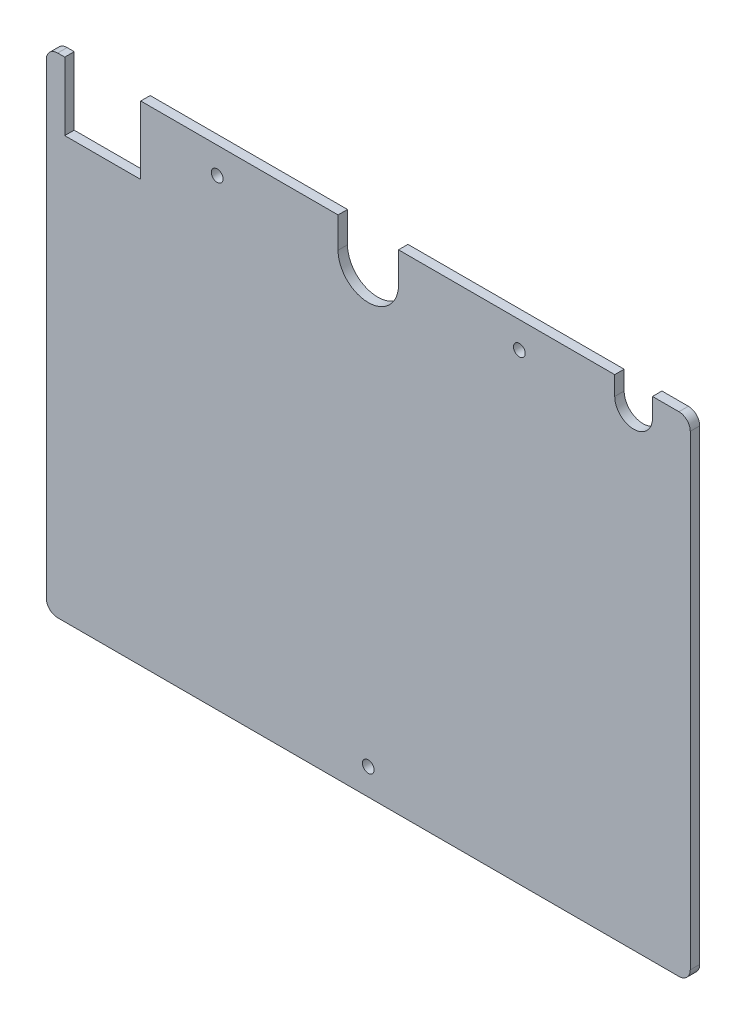
ISO-10303-21;
HEADER;
FILE_DESCRIPTION(('STEP AP214'),'2;1');
FILE_NAME('part.step','',(''),(''),'','','');
FILE_SCHEMA(('AUTOMOTIVE_DESIGN { 1 0 10303 214 1 1 1 1 }'));
ENDSEC;
DATA;
#1=APPLICATION_CONTEXT('core data for automotive mechanical design processes');
#2=APPLICATION_PROTOCOL_DEFINITION('international standard','automotive_design',2000,#1);
#3=PRODUCT_CONTEXT('',#1,'mechanical');
#4=PRODUCT('Part','Part','',(#3));
#5=PRODUCT_RELATED_PRODUCT_CATEGORY('part','',(#4));
#6=PRODUCT_DEFINITION_FORMATION('','',#4);
#7=PRODUCT_DEFINITION_CONTEXT('part definition',#1,'design');
#8=PRODUCT_DEFINITION('design','',#6,#7);
#9=PRODUCT_DEFINITION_SHAPE('','',#8);
#10=(LENGTH_UNIT() NAMED_UNIT(*) SI_UNIT(.MILLI.,.METRE.));
#11=(NAMED_UNIT(*) PLANE_ANGLE_UNIT() SI_UNIT($,.RADIAN.));
#12=(NAMED_UNIT(*) SI_UNIT($,.STERADIAN.) SOLID_ANGLE_UNIT());
#13=UNCERTAINTY_MEASURE_WITH_UNIT(LENGTH_MEASURE(1.E-05),#10,'distance_accuracy_value','');
#14=(GEOMETRIC_REPRESENTATION_CONTEXT(3) GLOBAL_UNCERTAINTY_ASSIGNED_CONTEXT((#13)) GLOBAL_UNIT_ASSIGNED_CONTEXT((#10,
#11,#12)) REPRESENTATION_CONTEXT('',''));
#15=CARTESIAN_POINT('',(0.,0.,0.));
#16=DIRECTION('',(0.,0.,1.));
#17=DIRECTION('',(1.,0.,0.));
#18=AXIS2_PLACEMENT_3D('',#15,#16,#17);
#19=CARTESIAN_POINT('',(-82.25,64.75,2.5));
#20=DIRECTION('',(0.,-1.,0.));
#21=DIRECTION('',(0.,0.,-1.));
#22=AXIS2_PLACEMENT_3D('',#19,#20,#21);
#23=PLANE('',#22);
#24=DIRECTION('',(-1.,0.,0.));
#25=VECTOR('',#24,1.);
#26=CARTESIAN_POINT('',(-82.25,64.75,0.));
#27=LINE('',#26,#25);
#28=CARTESIAN_POINT('',(-8.,64.75,0.));
#29=VERTEX_POINT('',#28);
#30=CARTESIAN_POINT('',(-60.25,64.75,0.));
#31=VERTEX_POINT('',#30);
#32=EDGE_CURVE('E189',#29,#31,#27,.T.);
#33=ORIENTED_EDGE('',*,*,#32,.T.);
#34=DIRECTION('',(0.,0.,1.));
#35=VECTOR('',#34,1.);
#36=CARTESIAN_POINT('',(-60.25,64.75,0.));
#37=LINE('',#36,#35);
#38=CARTESIAN_POINT('',(-60.25,64.75,2.5));
#39=VERTEX_POINT('',#38);
#40=EDGE_CURVE('E172',#31,#39,#37,.T.);
#41=ORIENTED_EDGE('',*,*,#40,.T.);
#42=DIRECTION('',(-1.,0.,0.));
#43=VECTOR('',#42,1.);
#44=CARTESIAN_POINT('',(-82.25,64.75,2.5));
#45=LINE('',#44,#43);
#46=CARTESIAN_POINT('',(-8.,64.75,2.5));
#47=VERTEX_POINT('',#46);
#48=EDGE_CURVE('E357',#47,#39,#45,.T.);
#49=ORIENTED_EDGE('',*,*,#48,.F.);
#50=DIRECTION('',(0.,0.,1.));
#51=VECTOR('',#50,1.);
#52=CARTESIAN_POINT('',(-8.,64.75,0.));
#53=LINE('',#52,#51);
#54=EDGE_CURVE('E195',#29,#47,#53,.T.);
#55=ORIENTED_EDGE('',*,*,#54,.F.);
#56=EDGE_LOOP('',(#33,#41,#49,#55));
#57=FACE_BOUND('',#56,.T.);
#58=ADVANCED_FACE('F35',(#57),#23,.F.);
#59=CARTESIAN_POINT('',(-80.3641675290053,64.75,2.5));
#60=VERTEX_POINT('',#59);
#61=CARTESIAN_POINT('',(-82.25,64.75,2.5));
#62=VERTEX_POINT('',#61);
#63=EDGE_CURVE('E258',#60,#62,#45,.T.);
#64=ORIENTED_EDGE('',*,*,#63,.F.);
#65=DIRECTION('',(0.,0.,1.));
#66=VECTOR('',#65,1.);
#67=CARTESIAN_POINT('',(-80.3641675290053,64.75,0.));
#68=LINE('',#67,#66);
#69=CARTESIAN_POINT('',(-80.3641675290053,64.75,0.));
#70=VERTEX_POINT('',#69);
#71=EDGE_CURVE('E182',#70,#60,#68,.T.);
#72=ORIENTED_EDGE('',*,*,#71,.F.);
#73=CARTESIAN_POINT('',(-82.25,64.75,0.));
#74=VERTEX_POINT('',#73);
#75=EDGE_CURVE('E197',#70,#74,#27,.T.);
#76=ORIENTED_EDGE('',*,*,#75,.T.);
#77=DIRECTION('',(0.,0.,-1.));
#78=VECTOR('',#77,1.);
#79=CARTESIAN_POINT('',(-82.25,64.75,2.5));
#80=LINE('',#79,#78);
#81=EDGE_CURVE('E218',#62,#74,#80,.T.);
#82=ORIENTED_EDGE('',*,*,#81,.F.);
#83=EDGE_LOOP('',(#64,#72,#76,#82));
#84=FACE_BOUND('',#83,.T.);
#85=ADVANCED_FACE('F353',(#84),#23,.F.);
#86=CARTESIAN_POINT('',(65.25,64.75,0.));
#87=VERTEX_POINT('',#86);
#88=CARTESIAN_POINT('',(7.99999999999998,64.75,0.));
#89=VERTEX_POINT('',#88);
#90=EDGE_CURVE('E196',#87,#89,#27,.T.);
#91=ORIENTED_EDGE('',*,*,#90,.T.);
#92=DIRECTION('',(0.,0.,1.));
#93=VECTOR('',#92,1.);
#94=CARTESIAN_POINT('',(8.,64.75,0.));
#95=LINE('',#94,#93);
#96=CARTESIAN_POINT('',(8.,64.75,2.5));
#97=VERTEX_POINT('',#96);
#98=EDGE_CURVE('E296',#89,#97,#95,.T.);
#99=ORIENTED_EDGE('',*,*,#98,.T.);
#100=CARTESIAN_POINT('',(65.25,64.75,2.5));
#101=VERTEX_POINT('',#100);
#102=EDGE_CURVE('E257',#101,#97,#45,.T.);
#103=ORIENTED_EDGE('',*,*,#102,.F.);
#104=DIRECTION('',(0.,0.,1.));
#105=VECTOR('',#104,1.);
#106=CARTESIAN_POINT('',(65.25,64.75,0.));
#107=LINE('',#106,#105);
#108=EDGE_CURVE('E275',#87,#101,#107,.T.);
#109=ORIENTED_EDGE('',*,*,#108,.F.);
#110=EDGE_LOOP('',(#91,#99,#103,#109));
#111=FACE_BOUND('',#110,.T.);
#112=ADVANCED_FACE('F369',(#111),#23,.F.);
#113=CARTESIAN_POINT('',(-82.25,-61.75,2.5));
#114=DIRECTION('',(0.,0.,-1.));
#115=DIRECTION('',(-1.,0.,0.));
#116=AXIS2_PLACEMENT_3D('',#113,#114,#115);
#117=CYLINDRICAL_SURFACE('',#116,3.);
#118=CARTESIAN_POINT('',(-82.25,-61.75,0.));
#119=DIRECTION('',(0.,0.,1.));
#120=DIRECTION('',(1.,0.,0.));
#121=AXIS2_PLACEMENT_3D('',#118,#119,#120);
#122=CIRCLE('',#121,3.);
#123=CARTESIAN_POINT('',(-85.25,-61.75,0.));
#124=VERTEX_POINT('',#123);
#125=CARTESIAN_POINT('',(-82.25,-64.75,0.));
#126=VERTEX_POINT('',#125);
#127=EDGE_CURVE('E245',#124,#126,#122,.T.);
#128=ORIENTED_EDGE('',*,*,#127,.T.);
#129=DIRECTION('',(0.,0.,-1.));
#130=VECTOR('',#129,1.);
#131=CARTESIAN_POINT('',(-82.25,-64.75,2.5));
#132=LINE('',#131,#130);
#133=CARTESIAN_POINT('',(-82.25,-64.75,2.5));
#134=VERTEX_POINT('',#133);
#135=EDGE_CURVE('E11',#134,#126,#132,.T.);
#136=ORIENTED_EDGE('',*,*,#135,.F.);
#137=CARTESIAN_POINT('',(-82.25,-61.75,2.5));
#138=DIRECTION('',(0.,0.,1.));
#139=DIRECTION('',(1.,0.,0.));
#140=AXIS2_PLACEMENT_3D('',#137,#138,#139);
#141=CIRCLE('',#140,3.);
#142=CARTESIAN_POINT('',(-85.25,-61.75,2.5));
#143=VERTEX_POINT('',#142);
#144=EDGE_CURVE('E210',#143,#134,#141,.T.);
#145=ORIENTED_EDGE('',*,*,#144,.F.);
#146=DIRECTION('',(0.,0.,-1.));
#147=VECTOR('',#146,1.);
#148=CARTESIAN_POINT('',(-85.25,-61.75,2.5));
#149=LINE('',#148,#147);
#150=EDGE_CURVE('E211',#143,#124,#149,.T.);
#151=ORIENTED_EDGE('',*,*,#150,.T.);
#152=EDGE_LOOP('',(#128,#136,#145,#151));
#153=FACE_BOUND('',#152,.T.);
#154=ADVANCED_FACE('F37',(#153),#117,.T.);
#155=CARTESIAN_POINT('',(-82.25,-64.75,2.5));
#156=DIRECTION('',(0.,1.,0.));
#157=DIRECTION('',(0.,0.,1.));
#158=AXIS2_PLACEMENT_3D('',#155,#156,#157);
#159=PLANE('',#158);
#160=DIRECTION('',(1.,0.,0.));
#161=VECTOR('',#160,1.);
#162=CARTESIAN_POINT('',(-82.25,-64.75,0.));
#163=LINE('',#162,#161);
#164=CARTESIAN_POINT('',(82.25,-64.75,0.));
#165=VERTEX_POINT('',#164);
#166=EDGE_CURVE('E241',#126,#165,#163,.T.);
#167=ORIENTED_EDGE('',*,*,#166,.T.);
#168=DIRECTION('',(0.,0.,-1.));
#169=VECTOR('',#168,1.);
#170=CARTESIAN_POINT('',(82.25,-64.75,2.5));
#171=LINE('',#170,#169);
#172=CARTESIAN_POINT('',(82.25,-64.75,2.5));
#173=VERTEX_POINT('',#172);
#174=EDGE_CURVE('E43',#173,#165,#171,.T.);
#175=ORIENTED_EDGE('',*,*,#174,.F.);
#176=DIRECTION('',(1.,0.,0.));
#177=VECTOR('',#176,1.);
#178=CARTESIAN_POINT('',(-82.25,-64.75,2.5));
#179=LINE('',#178,#177);
#180=EDGE_CURVE('E264',#134,#173,#179,.T.);
#181=ORIENTED_EDGE('',*,*,#180,.F.);
#182=ORIENTED_EDGE('',*,*,#135,.T.);
#183=EDGE_LOOP('',(#167,#175,#181,#182));
#184=FACE_BOUND('',#183,.T.);
#185=ADVANCED_FACE('F414',(#184),#159,.F.);
#186=CARTESIAN_POINT('',(82.25,-61.75,2.5));
#187=DIRECTION('',(0.,0.,-1.));
#188=DIRECTION('',(-1.,0.,0.));
#189=AXIS2_PLACEMENT_3D('',#186,#187,#188);
#190=CYLINDRICAL_SURFACE('',#189,2.99999999999999);
#191=CARTESIAN_POINT('',(82.25,-61.75,0.));
#192=DIRECTION('',(0.,0.,1.));
#193=DIRECTION('',(1.,0.,0.));
#194=AXIS2_PLACEMENT_3D('',#191,#192,#193);
#195=CIRCLE('',#194,2.99999999999999);
#196=CARTESIAN_POINT('',(85.25,-61.75,0.));
#197=VERTEX_POINT('',#196);
#198=EDGE_CURVE('E236',#165,#197,#195,.T.);
#199=ORIENTED_EDGE('',*,*,#198,.T.);
#200=DIRECTION('',(0.,0.,-1.));
#201=VECTOR('',#200,1.);
#202=CARTESIAN_POINT('',(85.25,-61.75,2.5));
#203=LINE('',#202,#201);
#204=CARTESIAN_POINT('',(85.25,-61.75,2.5));
#205=VERTEX_POINT('',#204);
#206=EDGE_CURVE('E227',#205,#197,#203,.T.);
#207=ORIENTED_EDGE('',*,*,#206,.F.);
#208=CARTESIAN_POINT('',(82.25,-61.75,2.5));
#209=DIRECTION('',(0.,0.,1.));
#210=DIRECTION('',(1.,0.,0.));
#211=AXIS2_PLACEMENT_3D('',#208,#209,#210);
#212=CIRCLE('',#211,2.99999999999999);
#213=EDGE_CURVE('E237',#173,#205,#212,.T.);
#214=ORIENTED_EDGE('',*,*,#213,.F.);
#215=ORIENTED_EDGE('',*,*,#174,.T.);
#216=EDGE_LOOP('',(#199,#207,#214,#215));
#217=FACE_BOUND('',#216,.T.);
#218=ADVANCED_FACE('F234',(#217),#190,.T.);
#219=CARTESIAN_POINT('',(85.25,61.75,2.5));
#220=DIRECTION('',(-1.,0.,0.));
#221=DIRECTION('',(0.,-1.,0.));
#222=AXIS2_PLACEMENT_3D('',#219,#220,#221);
#223=PLANE('',#222);
#224=DIRECTION('',(0.,1.,0.));
#225=VECTOR('',#224,1.);
#226=CARTESIAN_POINT('',(85.25,61.75,0.));
#227=LINE('',#226,#225);
#228=CARTESIAN_POINT('',(85.25,61.75,0.));
#229=VERTEX_POINT('',#228);
#230=EDGE_CURVE('E243',#197,#229,#227,.T.);
#231=ORIENTED_EDGE('',*,*,#230,.T.);
#232=DIRECTION('',(0.,0.,-1.));
#233=VECTOR('',#232,1.);
#234=CARTESIAN_POINT('',(85.25,61.75,2.5));
#235=LINE('',#234,#233);
#236=CARTESIAN_POINT('',(85.25,61.75,2.5));
#237=VERTEX_POINT('',#236);
#238=EDGE_CURVE('E224',#237,#229,#235,.T.);
#239=ORIENTED_EDGE('',*,*,#238,.F.);
#240=DIRECTION('',(0.,1.,0.));
#241=VECTOR('',#240,1.);
#242=CARTESIAN_POINT('',(85.25,61.75,2.5));
#243=LINE('',#242,#241);
#244=EDGE_CURVE('E261',#205,#237,#243,.T.);
#245=ORIENTED_EDGE('',*,*,#244,.F.);
#246=ORIENTED_EDGE('',*,*,#206,.T.);
#247=EDGE_LOOP('',(#231,#239,#245,#246));
#248=FACE_BOUND('',#247,.T.);
#249=ADVANCED_FACE('F408',(#248),#223,.F.);
#250=CARTESIAN_POINT('',(82.25,61.75,2.5));
#251=DIRECTION('',(0.,0.,-1.));
#252=DIRECTION('',(-1.,0.,0.));
#253=AXIS2_PLACEMENT_3D('',#250,#251,#252);
#254=CYLINDRICAL_SURFACE('',#253,3.);
#255=CARTESIAN_POINT('',(82.25,61.75,0.));
#256=DIRECTION('',(0.,0.,1.));
#257=DIRECTION('',(-1.,0.,0.));
#258=AXIS2_PLACEMENT_3D('',#255,#256,#257);
#259=CIRCLE('',#258,3.);
#260=CARTESIAN_POINT('',(82.25,64.75,0.));
#261=VERTEX_POINT('',#260);
#262=EDGE_CURVE('E201',#229,#261,#259,.T.);
#263=ORIENTED_EDGE('',*,*,#262,.T.);
#264=DIRECTION('',(0.,0.,-1.));
#265=VECTOR('',#264,1.);
#266=CARTESIAN_POINT('',(82.25,64.75,2.5));
#267=LINE('',#266,#265);
#268=CARTESIAN_POINT('',(82.25,64.75,2.5));
#269=VERTEX_POINT('',#268);
#270=EDGE_CURVE('E221',#269,#261,#267,.T.);
#271=ORIENTED_EDGE('',*,*,#270,.F.);
#272=CARTESIAN_POINT('',(82.25,61.75,2.5));
#273=DIRECTION('',(0.,0.,1.));
#274=DIRECTION('',(-1.,0.,0.));
#275=AXIS2_PLACEMENT_3D('',#272,#273,#274);
#276=CIRCLE('',#275,3.);
#277=EDGE_CURVE('E259',#237,#269,#276,.T.);
#278=ORIENTED_EDGE('',*,*,#277,.F.);
#279=ORIENTED_EDGE('',*,*,#238,.T.);
#280=EDGE_LOOP('',(#263,#271,#278,#279));
#281=FACE_BOUND('',#280,.T.);
#282=ADVANCED_FACE('F400',(#281),#254,.T.);
#283=CARTESIAN_POINT('',(75.25,64.75,0.));
#284=VERTEX_POINT('',#283);
#285=EDGE_CURVE('E200',#261,#284,#27,.T.);
#286=ORIENTED_EDGE('',*,*,#285,.T.);
#287=DIRECTION('',(0.,0.,1.));
#288=VECTOR('',#287,1.);
#289=CARTESIAN_POINT('',(75.25,64.75,0.));
#290=LINE('',#289,#288);
#291=CARTESIAN_POINT('',(75.25,64.75,2.5));
#292=VERTEX_POINT('',#291);
#293=EDGE_CURVE('E272',#284,#292,#290,.T.);
#294=ORIENTED_EDGE('',*,*,#293,.T.);
#295=EDGE_CURVE('E254',#269,#292,#45,.T.);
#296=ORIENTED_EDGE('',*,*,#295,.F.);
#297=ORIENTED_EDGE('',*,*,#270,.T.);
#298=EDGE_LOOP('',(#286,#294,#296,#297));
#299=FACE_BOUND('',#298,.T.);
#300=ADVANCED_FACE('F392',(#299),#23,.F.);
#301=CARTESIAN_POINT('',(-82.25,61.75,2.5));
#302=DIRECTION('',(0.,0.,-1.));
#303=DIRECTION('',(-1.,0.,0.));
#304=AXIS2_PLACEMENT_3D('',#301,#302,#303);
#305=CYLINDRICAL_SURFACE('',#304,3.);
#306=CARTESIAN_POINT('',(-82.25,61.75,0.));
#307=DIRECTION('',(0.,0.,1.));
#308=DIRECTION('',(1.,0.,0.));
#309=AXIS2_PLACEMENT_3D('',#306,#307,#308);
#310=CIRCLE('',#309,3.);
#311=CARTESIAN_POINT('',(-85.25,61.75,0.));
#312=VERTEX_POINT('',#311);
#313=EDGE_CURVE('E205',#74,#312,#310,.T.);
#314=ORIENTED_EDGE('',*,*,#313,.T.);
#315=DIRECTION('',(0.,0.,-1.));
#316=VECTOR('',#315,1.);
#317=CARTESIAN_POINT('',(-85.25,61.75,2.5));
#318=LINE('',#317,#316);
#319=CARTESIAN_POINT('',(-85.25,61.75,2.5));
#320=VERTEX_POINT('',#319);
#321=EDGE_CURVE('E214',#320,#312,#318,.T.);
#322=ORIENTED_EDGE('',*,*,#321,.F.);
#323=CARTESIAN_POINT('',(-82.25,61.75,2.5));
#324=DIRECTION('',(0.,0.,1.));
#325=DIRECTION('',(1.,0.,0.));
#326=AXIS2_PLACEMENT_3D('',#323,#324,#325);
#327=CIRCLE('',#326,3.);
#328=EDGE_CURVE('E252',#62,#320,#327,.T.);
#329=ORIENTED_EDGE('',*,*,#328,.F.);
#330=ORIENTED_EDGE('',*,*,#81,.T.);
#331=EDGE_LOOP('',(#314,#322,#329,#330));
#332=FACE_BOUND('',#331,.T.);
#333=ADVANCED_FACE('F399',(#332),#305,.T.);
#334=CARTESIAN_POINT('',(-85.25,61.75,2.5));
#335=DIRECTION('',(1.,0.,0.));
#336=DIRECTION('',(0.,1.,0.));
#337=AXIS2_PLACEMENT_3D('',#334,#335,#336);
#338=PLANE('',#337);
#339=DIRECTION('',(0.,-1.,0.));
#340=VECTOR('',#339,1.);
#341=CARTESIAN_POINT('',(-85.25,61.75,0.));
#342=LINE('',#341,#340);
#343=EDGE_CURVE('E208',#312,#124,#342,.T.);
#344=ORIENTED_EDGE('',*,*,#343,.T.);
#345=ORIENTED_EDGE('',*,*,#150,.F.);
#346=DIRECTION('',(0.,-1.,0.));
#347=VECTOR('',#346,1.);
#348=CARTESIAN_POINT('',(-85.25,61.75,2.5));
#349=LINE('',#348,#347);
#350=EDGE_CURVE('E215',#320,#143,#349,.T.);
#351=ORIENTED_EDGE('',*,*,#350,.F.);
#352=ORIENTED_EDGE('',*,*,#321,.T.);
#353=EDGE_LOOP('',(#344,#345,#351,#352));
#354=FACE_BOUND('',#353,.T.);
#355=ADVANCED_FACE('F406',(#354),#338,.F.);
#356=CARTESIAN_POINT('',(-82.25,-61.75,2.5));
#357=DIRECTION('',(0.,0.,1.));
#358=DIRECTION('',(1.,0.,0.));
#359=AXIS2_PLACEMENT_3D('',#356,#357,#358);
#360=PLANE('',#359);
#361=DIRECTION('',(0.,1.,0.));
#362=VECTOR('',#361,1.);
#363=CARTESIAN_POINT('',(-60.25,64.75,2.5));
#364=LINE('',#363,#362);
#365=CARTESIAN_POINT('',(-60.25,46.75,2.5));
#366=VERTEX_POINT('',#365);
#367=EDGE_CURVE('E177',#366,#39,#364,.T.);
#368=ORIENTED_EDGE('',*,*,#367,.F.);
#369=DIRECTION('',(1.,0.,0.));
#370=VECTOR('',#369,1.);
#371=CARTESIAN_POINT('',(-60.25,46.75,2.5));
#372=LINE('',#371,#370);
#373=CARTESIAN_POINT('',(-80.3641675290053,46.75,2.5));
#374=VERTEX_POINT('',#373);
#375=EDGE_CURVE('E192',#374,#366,#372,.T.);
#376=ORIENTED_EDGE('',*,*,#375,.F.);
#377=DIRECTION('',(0.,-1.,0.));
#378=VECTOR('',#377,1.);
#379=CARTESIAN_POINT('',(-80.3641675290053,64.75,2.5));
#380=LINE('',#379,#378);
#381=EDGE_CURVE('E340',#60,#374,#380,.T.);
#382=ORIENTED_EDGE('',*,*,#381,.F.);
#383=ORIENTED_EDGE('',*,*,#63,.T.);
#384=ORIENTED_EDGE('',*,*,#328,.T.);
#385=ORIENTED_EDGE('',*,*,#350,.T.);
#386=ORIENTED_EDGE('',*,*,#144,.T.);
#387=ORIENTED_EDGE('',*,*,#180,.T.);
#388=ORIENTED_EDGE('',*,*,#213,.T.);
#389=ORIENTED_EDGE('',*,*,#244,.T.);
#390=ORIENTED_EDGE('',*,*,#277,.T.);
#391=ORIENTED_EDGE('',*,*,#295,.T.);
#392=DIRECTION('',(0.,1.,0.));
#393=VECTOR('',#392,1.);
#394=CARTESIAN_POINT('',(75.25,64.75,2.5));
#395=LINE('',#394,#393);
#396=CARTESIAN_POINT('',(75.25,59.75,2.5));
#397=VERTEX_POINT('',#396);
#398=EDGE_CURVE('E278',#397,#292,#395,.T.);
#399=ORIENTED_EDGE('',*,*,#398,.F.);
#400=CARTESIAN_POINT('',(70.25,59.75,2.5));
#401=DIRECTION('',(0.,0.,1.));
#402=DIRECTION('',(1.,0.,0.));
#403=AXIS2_PLACEMENT_3D('',#400,#401,#402);
#404=CIRCLE('',#403,5.00000000000002);
#405=CARTESIAN_POINT('',(65.25,59.75,2.5));
#406=VERTEX_POINT('',#405);
#407=EDGE_CURVE('E281',#406,#397,#404,.T.);
#408=ORIENTED_EDGE('',*,*,#407,.F.);
#409=DIRECTION('',(0.,-1.,0.));
#410=VECTOR('',#409,1.);
#411=CARTESIAN_POINT('',(65.25,64.75,2.5));
#412=LINE('',#411,#410);
#413=EDGE_CURVE('E284',#101,#406,#412,.T.);
#414=ORIENTED_EDGE('',*,*,#413,.F.);
#415=ORIENTED_EDGE('',*,*,#102,.T.);
#416=DIRECTION('',(0.,1.,0.));
#417=VECTOR('',#416,1.);
#418=CARTESIAN_POINT('',(8.,56.65,2.5));
#419=LINE('',#418,#417);
#420=CARTESIAN_POINT('',(8.,56.65,2.5));
#421=VERTEX_POINT('',#420);
#422=EDGE_CURVE('E307',#421,#97,#419,.T.);
#423=ORIENTED_EDGE('',*,*,#422,.F.);
#424=CARTESIAN_POINT('',(0.,56.65,2.5));
#425=DIRECTION('',(0.,0.,1.));
#426=DIRECTION('',(1.,0.,0.));
#427=AXIS2_PLACEMENT_3D('',#424,#425,#426);
#428=CIRCLE('',#427,8.);
#429=CARTESIAN_POINT('',(-8.,56.65,2.5));
#430=VERTEX_POINT('',#429);
#431=EDGE_CURVE('E277',#430,#421,#428,.T.);
#432=ORIENTED_EDGE('',*,*,#431,.F.);
#433=DIRECTION('',(0.,-1.,0.));
#434=VECTOR('',#433,1.);
#435=CARTESIAN_POINT('',(-8.,64.75,2.5));
#436=LINE('',#435,#434);
#437=EDGE_CURVE('E303',#47,#430,#436,.T.);
#438=ORIENTED_EDGE('',*,*,#437,.F.);
#439=ORIENTED_EDGE('',*,*,#48,.T.);
#440=EDGE_LOOP('',(#368,#376,#382,#383,#384,#385,#386,#387,#388,#389,#390,#391,#399,#408,#414,
#415,#423,#432,#438,#439));
#441=FACE_BOUND('',#440,.T.);
#442=CARTESIAN_POINT('',(40.,57.75,2.5));
#443=DIRECTION('',(0.,0.,1.));
#444=DIRECTION('',(-1.,0.,0.));
#445=AXIS2_PLACEMENT_3D('',#442,#443,#444);
#446=CIRCLE('',#445,1.55);
#447=CARTESIAN_POINT('',(38.45,57.75,2.5));
#448=VERTEX_POINT('',#447);
#449=EDGE_CURVE('E329',#448,#448,#446,.T.);
#450=ORIENTED_EDGE('',*,*,#449,.F.);
#451=EDGE_LOOP('',(#450));
#452=FACE_BOUND('',#451,.T.);
#453=CARTESIAN_POINT('',(0.,-57.75,2.5));
#454=DIRECTION('',(0.,0.,1.));
#455=DIRECTION('',(1.,0.,0.));
#456=AXIS2_PLACEMENT_3D('',#453,#454,#455);
#457=CIRCLE('',#456,1.55);
#458=CARTESIAN_POINT('',(1.55,-57.75,2.5));
#459=VERTEX_POINT('',#458);
#460=EDGE_CURVE('E324',#459,#459,#457,.T.);
#461=ORIENTED_EDGE('',*,*,#460,.F.);
#462=EDGE_LOOP('',(#461));
#463=FACE_BOUND('',#462,.T.);
#464=CARTESIAN_POINT('',(-40.,57.75,2.5));
#465=DIRECTION('',(0.,0.,1.));
#466=DIRECTION('',(1.,0.,0.));
#467=AXIS2_PLACEMENT_3D('',#464,#465,#466);
#468=CIRCLE('',#467,1.55);
#469=CARTESIAN_POINT('',(-38.45,57.75,2.5));
#470=VERTEX_POINT('',#469);
#471=EDGE_CURVE('E317',#470,#470,#468,.T.);
#472=ORIENTED_EDGE('',*,*,#471,.F.);
#473=EDGE_LOOP('',(#472));
#474=FACE_BOUND('',#473,.T.);
#475=ADVANCED_FACE('F363',(#441,#452,#463,#474),#360,.T.);
#476=CARTESIAN_POINT('',(-82.25,-61.75,0.));
#477=DIRECTION('',(0.,0.,1.));
#478=DIRECTION('',(1.,0.,0.));
#479=AXIS2_PLACEMENT_3D('',#476,#477,#478);
#480=PLANE('',#479);
#481=CARTESIAN_POINT('',(40.,57.75,0.));
#482=DIRECTION('',(0.,0.,1.));
#483=DIRECTION('',(-1.,0.,0.));
#484=AXIS2_PLACEMENT_3D('',#481,#482,#483);
#485=CIRCLE('',#484,1.55);
#486=CARTESIAN_POINT('',(38.45,57.75,0.));
#487=VERTEX_POINT('',#486);
#488=EDGE_CURVE('E321',#487,#487,#485,.T.);
#489=ORIENTED_EDGE('',*,*,#488,.T.);
#490=EDGE_LOOP('',(#489));
#491=FACE_BOUND('',#490,.T.);
#492=DIRECTION('',(1.,0.,0.));
#493=VECTOR('',#492,1.);
#494=CARTESIAN_POINT('',(-60.25,46.75,0.));
#495=LINE('',#494,#493);
#496=CARTESIAN_POINT('',(-80.3641675290053,46.75,0.));
#497=VERTEX_POINT('',#496);
#498=CARTESIAN_POINT('',(-60.25,46.75,0.));
#499=VERTEX_POINT('',#498);
#500=EDGE_CURVE('E50',#497,#499,#495,.T.);
#501=ORIENTED_EDGE('',*,*,#500,.T.);
#502=DIRECTION('',(0.,1.,0.));
#503=VECTOR('',#502,1.);
#504=CARTESIAN_POINT('',(-60.25,64.75,0.));
#505=LINE('',#504,#503);
#506=EDGE_CURVE('E175',#499,#31,#505,.T.);
#507=ORIENTED_EDGE('',*,*,#506,.T.);
#508=ORIENTED_EDGE('',*,*,#32,.F.);
#509=DIRECTION('',(0.,-1.,0.));
#510=VECTOR('',#509,1.);
#511=CARTESIAN_POINT('',(-8.,64.75,0.));
#512=LINE('',#511,#510);
#513=CARTESIAN_POINT('',(-8.,56.65,0.));
#514=VERTEX_POINT('',#513);
#515=EDGE_CURVE('E297',#29,#514,#512,.T.);
#516=ORIENTED_EDGE('',*,*,#515,.T.);
#517=CARTESIAN_POINT('',(0.,56.65,0.));
#518=DIRECTION('',(0.,0.,1.));
#519=DIRECTION('',(1.,0.,0.));
#520=AXIS2_PLACEMENT_3D('',#517,#518,#519);
#521=CIRCLE('',#520,8.);
#522=CARTESIAN_POINT('',(8.,56.65,0.));
#523=VERTEX_POINT('',#522);
#524=EDGE_CURVE('E306',#514,#523,#521,.T.);
#525=ORIENTED_EDGE('',*,*,#524,.T.);
#526=DIRECTION('',(0.,1.,0.));
#527=VECTOR('',#526,1.);
#528=CARTESIAN_POINT('',(8.,56.65,0.));
#529=LINE('',#528,#527);
#530=EDGE_CURVE('E312',#523,#89,#529,.T.);
#531=ORIENTED_EDGE('',*,*,#530,.T.);
#532=ORIENTED_EDGE('',*,*,#90,.F.);
#533=DIRECTION('',(0.,-1.,0.));
#534=VECTOR('',#533,1.);
#535=CARTESIAN_POINT('',(65.25,64.75,0.));
#536=LINE('',#535,#534);
#537=CARTESIAN_POINT('',(65.25,59.75,0.));
#538=VERTEX_POINT('',#537);
#539=EDGE_CURVE('E280',#87,#538,#536,.T.);
#540=ORIENTED_EDGE('',*,*,#539,.T.);
#541=CARTESIAN_POINT('',(70.25,59.75,0.));
#542=DIRECTION('',(0.,0.,1.));
#543=DIRECTION('',(1.,0.,0.));
#544=AXIS2_PLACEMENT_3D('',#541,#542,#543);
#545=CIRCLE('',#544,5.00000000000002);
#546=CARTESIAN_POINT('',(75.25,59.75,0.));
#547=VERTEX_POINT('',#546);
#548=EDGE_CURVE('E289',#538,#547,#545,.T.);
#549=ORIENTED_EDGE('',*,*,#548,.T.);
#550=DIRECTION('',(0.,1.,0.));
#551=VECTOR('',#550,1.);
#552=CARTESIAN_POINT('',(75.25,64.75,0.));
#553=LINE('',#552,#551);
#554=EDGE_CURVE('E58',#547,#284,#553,.T.);
#555=ORIENTED_EDGE('',*,*,#554,.T.);
#556=ORIENTED_EDGE('',*,*,#285,.F.);
#557=ORIENTED_EDGE('',*,*,#262,.F.);
#558=ORIENTED_EDGE('',*,*,#230,.F.);
#559=ORIENTED_EDGE('',*,*,#198,.F.);
#560=ORIENTED_EDGE('',*,*,#166,.F.);
#561=ORIENTED_EDGE('',*,*,#127,.F.);
#562=ORIENTED_EDGE('',*,*,#343,.F.);
#563=ORIENTED_EDGE('',*,*,#313,.F.);
#564=ORIENTED_EDGE('',*,*,#75,.F.);
#565=DIRECTION('',(0.,-1.,0.));
#566=VECTOR('',#565,1.);
#567=CARTESIAN_POINT('',(-80.3641675290053,64.75,0.));
#568=LINE('',#567,#566);
#569=EDGE_CURVE('E191',#70,#497,#568,.T.);
#570=ORIENTED_EDGE('',*,*,#569,.T.);
#571=EDGE_LOOP('',(#501,#507,#508,#516,#525,#531,#532,#540,#549,#555,#556,#557,#558,#559,#560,
#561,#562,#563,#564,#570));
#572=FACE_BOUND('',#571,.T.);
#573=CARTESIAN_POINT('',(0.,-57.75,0.));
#574=DIRECTION('',(0.,0.,1.));
#575=DIRECTION('',(1.,0.,0.));
#576=AXIS2_PLACEMENT_3D('',#573,#574,#575);
#577=CIRCLE('',#576,1.55);
#578=CARTESIAN_POINT('',(1.55,-57.75,0.));
#579=VERTEX_POINT('',#578);
#580=EDGE_CURVE('E287',#579,#579,#577,.T.);
#581=ORIENTED_EDGE('',*,*,#580,.T.);
#582=EDGE_LOOP('',(#581));
#583=FACE_BOUND('',#582,.T.);
#584=CARTESIAN_POINT('',(-40.,57.75,0.));
#585=DIRECTION('',(0.,0.,1.));
#586=DIRECTION('',(1.,0.,0.));
#587=AXIS2_PLACEMENT_3D('',#584,#585,#586);
#588=CIRCLE('',#587,1.55);
#589=CARTESIAN_POINT('',(-38.45,57.75,0.));
#590=VERTEX_POINT('',#589);
#591=EDGE_CURVE('E320',#590,#590,#588,.T.);
#592=ORIENTED_EDGE('',*,*,#591,.T.);
#593=EDGE_LOOP('',(#592));
#594=FACE_BOUND('',#593,.T.);
#595=ADVANCED_FACE('F186',(#491,#572,#583,#594),#480,.F.);
#596=CARTESIAN_POINT('',(-40.,57.75,0.));
#597=DIRECTION('',(0.,0.,1.));
#598=DIRECTION('',(1.,0.,0.));
#599=AXIS2_PLACEMENT_3D('',#596,#597,#598);
#600=CYLINDRICAL_SURFACE('',#599,1.55);
#601=ORIENTED_EDGE('',*,*,#591,.F.);
#602=EDGE_LOOP('',(#601));
#603=FACE_BOUND('',#602,.T.);
#604=ORIENTED_EDGE('',*,*,#471,.T.);
#605=EDGE_LOOP('',(#604));
#606=FACE_BOUND('',#605,.T.);
#607=ADVANCED_FACE('F447',(#603,#606),#600,.F.);
#608=CARTESIAN_POINT('',(0.,-57.75,0.));
#609=DIRECTION('',(0.,0.,1.));
#610=DIRECTION('',(1.,0.,0.));
#611=AXIS2_PLACEMENT_3D('',#608,#609,#610);
#612=CYLINDRICAL_SURFACE('',#611,1.55);
#613=ORIENTED_EDGE('',*,*,#580,.F.);
#614=EDGE_LOOP('',(#613));
#615=FACE_BOUND('',#614,.T.);
#616=ORIENTED_EDGE('',*,*,#460,.T.);
#617=EDGE_LOOP('',(#616));
#618=FACE_BOUND('',#617,.T.);
#619=ADVANCED_FACE('F440',(#615,#618),#612,.F.);
#620=CARTESIAN_POINT('',(65.25,64.75,0.));
#621=DIRECTION('',(-1.,0.,0.));
#622=DIRECTION('',(0.,0.,1.));
#623=AXIS2_PLACEMENT_3D('',#620,#621,#622);
#624=PLANE('',#623);
#625=ORIENTED_EDGE('',*,*,#413,.T.);
#626=DIRECTION('',(0.,0.,1.));
#627=VECTOR('',#626,1.);
#628=CARTESIAN_POINT('',(65.25,59.75,0.));
#629=LINE('',#628,#627);
#630=EDGE_CURVE('E268',#538,#406,#629,.T.);
#631=ORIENTED_EDGE('',*,*,#630,.F.);
#632=ORIENTED_EDGE('',*,*,#539,.F.);
#633=ORIENTED_EDGE('',*,*,#108,.T.);
#634=EDGE_LOOP('',(#625,#631,#632,#633));
#635=FACE_BOUND('',#634,.T.);
#636=ADVANCED_FACE('F438',(#635),#624,.F.);
#637=CARTESIAN_POINT('',(75.25,64.75,0.));
#638=DIRECTION('',(1.,0.,0.));
#639=DIRECTION('',(0.,1.,0.));
#640=AXIS2_PLACEMENT_3D('',#637,#638,#639);
#641=PLANE('',#640);
#642=ORIENTED_EDGE('',*,*,#398,.T.);
#643=ORIENTED_EDGE('',*,*,#293,.F.);
#644=ORIENTED_EDGE('',*,*,#554,.F.);
#645=DIRECTION('',(0.,0.,1.));
#646=VECTOR('',#645,1.);
#647=CARTESIAN_POINT('',(75.25,59.75,0.));
#648=LINE('',#647,#646);
#649=EDGE_CURVE('E270',#547,#397,#648,.T.);
#650=ORIENTED_EDGE('',*,*,#649,.T.);
#651=EDGE_LOOP('',(#642,#643,#644,#650));
#652=FACE_BOUND('',#651,.T.);
#653=ADVANCED_FACE('F434',(#652),#641,.F.);
#654=CARTESIAN_POINT('',(70.25,59.75,0.));
#655=DIRECTION('',(0.,0.,1.));
#656=DIRECTION('',(1.,0.,0.));
#657=AXIS2_PLACEMENT_3D('',#654,#655,#656);
#658=CYLINDRICAL_SURFACE('',#657,5.00000000000002);
#659=ORIENTED_EDGE('',*,*,#407,.T.);
#660=ORIENTED_EDGE('',*,*,#649,.F.);
#661=ORIENTED_EDGE('',*,*,#548,.F.);
#662=ORIENTED_EDGE('',*,*,#630,.T.);
#663=EDGE_LOOP('',(#659,#660,#661,#662));
#664=FACE_BOUND('',#663,.T.);
#665=ADVANCED_FACE('F387',(#664),#658,.F.);
#666=CARTESIAN_POINT('',(0.,56.65,0.));
#667=DIRECTION('',(0.,0.,1.));
#668=DIRECTION('',(1.,0.,0.));
#669=AXIS2_PLACEMENT_3D('',#666,#667,#668);
#670=CYLINDRICAL_SURFACE('',#669,8.);
#671=ORIENTED_EDGE('',*,*,#431,.T.);
#672=DIRECTION('',(0.,0.,1.));
#673=VECTOR('',#672,1.);
#674=CARTESIAN_POINT('',(8.,56.65,0.));
#675=LINE('',#674,#673);
#676=EDGE_CURVE('E294',#523,#421,#675,.T.);
#677=ORIENTED_EDGE('',*,*,#676,.F.);
#678=ORIENTED_EDGE('',*,*,#524,.F.);
#679=DIRECTION('',(0.,0.,1.));
#680=VECTOR('',#679,1.);
#681=CARTESIAN_POINT('',(-8.,56.65,0.));
#682=LINE('',#681,#680);
#683=EDGE_CURVE('E301',#514,#430,#682,.T.);
#684=ORIENTED_EDGE('',*,*,#683,.T.);
#685=EDGE_LOOP('',(#671,#677,#678,#684));
#686=FACE_BOUND('',#685,.T.);
#687=ADVANCED_FACE('F376',(#686),#670,.F.);
#688=CARTESIAN_POINT('',(-8.,64.75,0.));
#689=DIRECTION('',(-1.,0.,0.));
#690=DIRECTION('',(0.,-1.,0.));
#691=AXIS2_PLACEMENT_3D('',#688,#689,#690);
#692=PLANE('',#691);
#693=ORIENTED_EDGE('',*,*,#437,.T.);
#694=ORIENTED_EDGE('',*,*,#683,.F.);
#695=ORIENTED_EDGE('',*,*,#515,.F.);
#696=ORIENTED_EDGE('',*,*,#54,.T.);
#697=EDGE_LOOP('',(#693,#694,#695,#696));
#698=FACE_BOUND('',#697,.T.);
#699=ADVANCED_FACE('F378',(#698),#692,.F.);
#700=CARTESIAN_POINT('',(8.,56.65,0.));
#701=DIRECTION('',(1.,0.,0.));
#702=DIRECTION('',(0.,1.,0.));
#703=AXIS2_PLACEMENT_3D('',#700,#701,#702);
#704=PLANE('',#703);
#705=ORIENTED_EDGE('',*,*,#422,.T.);
#706=ORIENTED_EDGE('',*,*,#98,.F.);
#707=ORIENTED_EDGE('',*,*,#530,.F.);
#708=ORIENTED_EDGE('',*,*,#676,.T.);
#709=EDGE_LOOP('',(#705,#706,#707,#708));
#710=FACE_BOUND('',#709,.T.);
#711=ADVANCED_FACE('F373',(#710),#704,.F.);
#712=CARTESIAN_POINT('',(40.,57.75,0.));
#713=DIRECTION('',(0.,0.,1.));
#714=DIRECTION('',(1.,0.,0.));
#715=AXIS2_PLACEMENT_3D('',#712,#713,#714);
#716=CYLINDRICAL_SURFACE('',#715,1.55);
#717=ORIENTED_EDGE('',*,*,#488,.F.);
#718=EDGE_LOOP('',(#717));
#719=FACE_BOUND('',#718,.T.);
#720=ORIENTED_EDGE('',*,*,#449,.T.);
#721=EDGE_LOOP('',(#720));
#722=FACE_BOUND('',#721,.T.);
#723=ADVANCED_FACE('F385',(#719,#722),#716,.F.);
#724=CARTESIAN_POINT('',(-60.25,64.75,0.));
#725=DIRECTION('',(1.,0.,0.));
#726=DIRECTION('',(0.,1.,0.));
#727=AXIS2_PLACEMENT_3D('',#724,#725,#726);
#728=PLANE('',#727);
#729=ORIENTED_EDGE('',*,*,#367,.T.);
#730=ORIENTED_EDGE('',*,*,#40,.F.);
#731=ORIENTED_EDGE('',*,*,#506,.F.);
#732=DIRECTION('',(0.,0.,1.));
#733=VECTOR('',#732,1.);
#734=CARTESIAN_POINT('',(-60.25,46.75,0.));
#735=LINE('',#734,#733);
#736=EDGE_CURVE('E250',#499,#366,#735,.T.);
#737=ORIENTED_EDGE('',*,*,#736,.T.);
#738=EDGE_LOOP('',(#729,#730,#731,#737));
#739=FACE_BOUND('',#738,.T.);
#740=ADVANCED_FACE('F174',(#739),#728,.F.);
#741=CARTESIAN_POINT('',(-60.25,46.75,0.));
#742=DIRECTION('',(0.,-1.,0.));
#743=DIRECTION('',(0.,0.,-1.));
#744=AXIS2_PLACEMENT_3D('',#741,#742,#743);
#745=PLANE('',#744);
#746=ORIENTED_EDGE('',*,*,#375,.T.);
#747=ORIENTED_EDGE('',*,*,#736,.F.);
#748=ORIENTED_EDGE('',*,*,#500,.F.);
#749=DIRECTION('',(0.,0.,1.));
#750=VECTOR('',#749,1.);
#751=CARTESIAN_POINT('',(-80.3641675290053,46.75,0.));
#752=LINE('',#751,#750);
#753=EDGE_CURVE('E335',#497,#374,#752,.T.);
#754=ORIENTED_EDGE('',*,*,#753,.T.);
#755=EDGE_LOOP('',(#746,#747,#748,#754));
#756=FACE_BOUND('',#755,.T.);
#757=ADVANCED_FACE('F531',(#756),#745,.F.);
#758=CARTESIAN_POINT('',(-80.3641675290053,64.75,0.));
#759=DIRECTION('',(-1.,0.,0.));
#760=DIRECTION('',(0.,0.,1.));
#761=AXIS2_PLACEMENT_3D('',#758,#759,#760);
#762=PLANE('',#761);
#763=ORIENTED_EDGE('',*,*,#381,.T.);
#764=ORIENTED_EDGE('',*,*,#753,.F.);
#765=ORIENTED_EDGE('',*,*,#569,.F.);
#766=ORIENTED_EDGE('',*,*,#71,.T.);
#767=EDGE_LOOP('',(#763,#764,#765,#766));
#768=FACE_BOUND('',#767,.T.);
#769=ADVANCED_FACE('F349',(#768),#762,.F.);
#770=CLOSED_SHELL('',(#58,#85,#112,#154,#185,#218,#249,#282,#300,#333,#355,#475,#595,#607,#619,
#636,#653,#665,#687,#699,#711,#723,#740,#757,#769));
#771=MANIFOLD_SOLID_BREP('B2',#770);
#772=ADVANCED_BREP_SHAPE_REPRESENTATION('',(#18,#771),#14);
#773=SHAPE_DEFINITION_REPRESENTATION(#9,#772);
ENDSEC;
END-ISO-10303-21;
